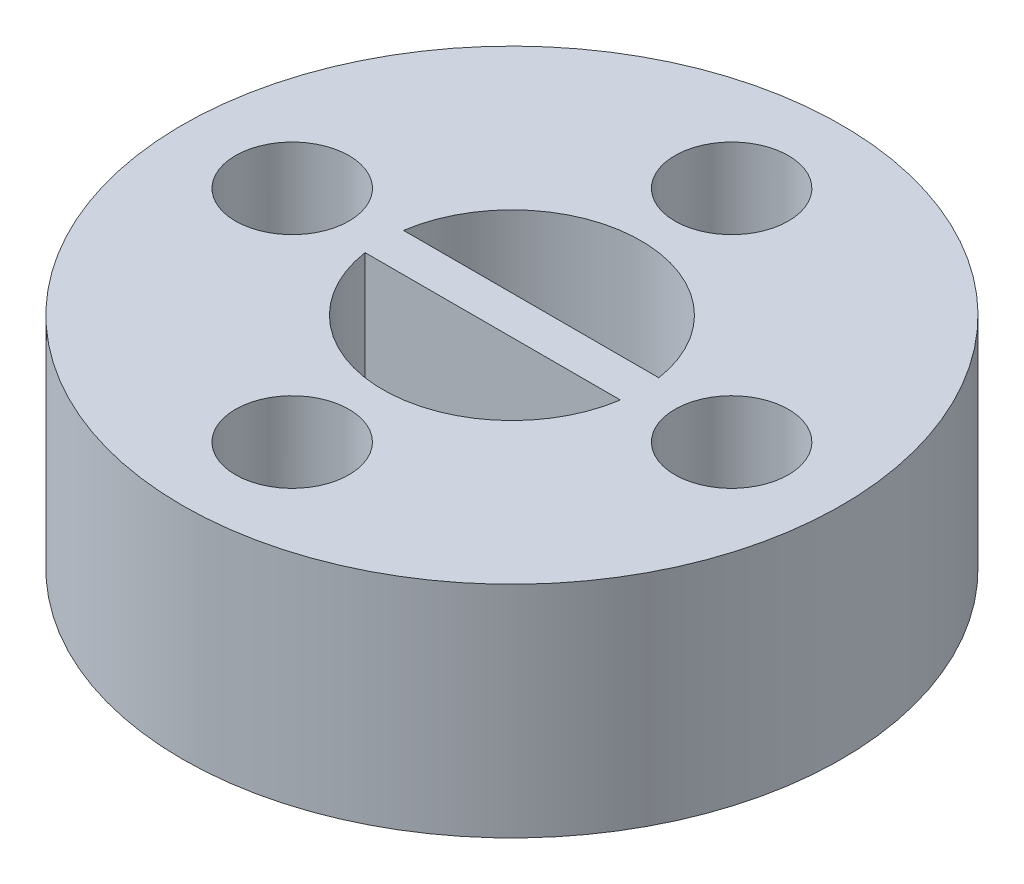
ISO-10303-21;
HEADER;
FILE_DESCRIPTION(('STEP AP214'),'2;1');
FILE_NAME('part.step','',(''),(''),'','','');
FILE_SCHEMA(('AUTOMOTIVE_DESIGN { 1 0 10303 214 1 1 1 1 }'));
ENDSEC;
DATA;
#1=APPLICATION_CONTEXT('core data for automotive mechanical design processes');
#2=APPLICATION_PROTOCOL_DEFINITION('international standard','automotive_design',2000,#1);
#3=PRODUCT_CONTEXT('',#1,'mechanical');
#4=PRODUCT('Part','Part','',(#3));
#5=PRODUCT_RELATED_PRODUCT_CATEGORY('part','',(#4));
#6=PRODUCT_DEFINITION_FORMATION('','',#4);
#7=PRODUCT_DEFINITION_CONTEXT('part definition',#1,'design');
#8=PRODUCT_DEFINITION('design','',#6,#7);
#9=PRODUCT_DEFINITION_SHAPE('','',#8);
#10=(LENGTH_UNIT() NAMED_UNIT(*) SI_UNIT(.MILLI.,.METRE.));
#11=(NAMED_UNIT(*) PLANE_ANGLE_UNIT() SI_UNIT($,.RADIAN.));
#12=(NAMED_UNIT(*) SI_UNIT($,.STERADIAN.) SOLID_ANGLE_UNIT());
#13=UNCERTAINTY_MEASURE_WITH_UNIT(LENGTH_MEASURE(1.E-05),#10,'distance_accuracy_value','');
#14=(GEOMETRIC_REPRESENTATION_CONTEXT(3) GLOBAL_UNCERTAINTY_ASSIGNED_CONTEXT((#13)) GLOBAL_UNIT_ASSIGNED_CONTEXT((#10,
#11,#12)) REPRESENTATION_CONTEXT('',''));
#15=CARTESIAN_POINT('',(0.,0.,0.));
#16=DIRECTION('',(0.,0.,1.));
#17=DIRECTION('',(1.,0.,0.));
#18=AXIS2_PLACEMENT_3D('',#15,#16,#17);
#19=CARTESIAN_POINT('',(0.,6.,0.));
#20=DIRECTION('',(0.,-1.,0.));
#21=DIRECTION('',(0.,0.,-1.));
#22=AXIS2_PLACEMENT_3D('',#19,#20,#21);
#23=CYLINDRICAL_SURFACE('',#22,3.525);
#24=CARTESIAN_POINT('',(0.,6.,0.));
#25=DIRECTION('',(0.,1.,0.));
#26=DIRECTION('',(0.,0.,1.));
#27=AXIS2_PLACEMENT_3D('',#24,#25,#26);
#28=CIRCLE('',#27,3.525);
#29=CARTESIAN_POINT('',(-3.48568501158668,6.,0.525));
#30=VERTEX_POINT('',#29);
#31=CARTESIAN_POINT('',(3.48568501158668,6.,0.525));
#32=VERTEX_POINT('',#31);
#33=EDGE_CURVE('E92',#30,#32,#28,.T.);
#34=ORIENTED_EDGE('',*,*,#33,.T.);
#35=DIRECTION('',(0.,-1.,0.));
#36=VECTOR('',#35,1.);
#37=CARTESIAN_POINT('',(3.48568501158668,6.,0.525));
#38=LINE('',#37,#36);
#39=CARTESIAN_POINT('',(3.48568501158668,0.,0.525));
#40=VERTEX_POINT('',#39);
#41=EDGE_CURVE('E11',#32,#40,#38,.T.);
#42=ORIENTED_EDGE('',*,*,#41,.T.);
#43=CARTESIAN_POINT('',(0.,0.,0.));
#44=DIRECTION('',(0.,1.,0.));
#45=DIRECTION('',(0.,0.,1.));
#46=AXIS2_PLACEMENT_3D('',#43,#44,#45);
#47=CIRCLE('',#46,3.525);
#48=CARTESIAN_POINT('',(-3.48568501158668,0.,0.525));
#49=VERTEX_POINT('',#48);
#50=EDGE_CURVE('E93',#49,#40,#47,.T.);
#51=ORIENTED_EDGE('',*,*,#50,.F.);
#52=DIRECTION('',(0.,-1.,0.));
#53=VECTOR('',#52,1.);
#54=CARTESIAN_POINT('',(-3.48568501158668,6.,0.525));
#55=LINE('',#54,#53);
#56=EDGE_CURVE('E42',#49,#30,#55,.F.);
#57=ORIENTED_EDGE('',*,*,#56,.T.);
#58=EDGE_LOOP('',(#34,#42,#51,#57));
#59=FACE_BOUND('',#58,.T.);
#60=ADVANCED_FACE('F33',(#59),#23,.F.);
#61=CARTESIAN_POINT('',(3.48568501158668,6.,-0.525));
#62=VERTEX_POINT('',#61);
#63=CARTESIAN_POINT('',(-3.48568501158668,6.,-0.525));
#64=VERTEX_POINT('',#63);
#65=EDGE_CURVE('E88',#62,#64,#28,.T.);
#66=ORIENTED_EDGE('',*,*,#65,.T.);
#67=DIRECTION('',(0.,-1.,0.));
#68=VECTOR('',#67,1.);
#69=CARTESIAN_POINT('',(-3.48568501158668,6.,-0.525));
#70=LINE('',#69,#68);
#71=CARTESIAN_POINT('',(-3.48568501158668,0.,-0.525));
#72=VERTEX_POINT('',#71);
#73=EDGE_CURVE('E76',#64,#72,#70,.T.);
#74=ORIENTED_EDGE('',*,*,#73,.T.);
#75=CARTESIAN_POINT('',(3.48568501158668,0.,-0.525));
#76=VERTEX_POINT('',#75);
#77=EDGE_CURVE('E86',#76,#72,#47,.T.);
#78=ORIENTED_EDGE('',*,*,#77,.F.);
#79=DIRECTION('',(0.,-1.,0.));
#80=VECTOR('',#79,1.);
#81=CARTESIAN_POINT('',(3.48568501158668,6.,-0.525));
#82=LINE('',#81,#80);
#83=EDGE_CURVE('E79',#76,#62,#82,.F.);
#84=ORIENTED_EDGE('',*,*,#83,.T.);
#85=EDGE_LOOP('',(#66,#74,#78,#84));
#86=FACE_BOUND('',#85,.T.);
#87=ADVANCED_FACE('F85',(#86),#23,.F.);
#88=CARTESIAN_POINT('',(0.,6.,0.));
#89=DIRECTION('',(0.,1.,0.));
#90=DIRECTION('',(0.,0.,1.));
#91=AXIS2_PLACEMENT_3D('',#88,#89,#90);
#92=PLANE('',#91);
#93=CARTESIAN_POINT('',(0.,6.,6.));
#94=DIRECTION('',(0.,1.,0.));
#95=DIRECTION('',(-1.,0.,0.));
#96=AXIS2_PLACEMENT_3D('',#93,#94,#95);
#97=CIRCLE('',#96,1.55);
#98=CARTESIAN_POINT('',(-1.55000000000002,6.,5.99999999999999));
#99=VERTEX_POINT('',#98);
#100=EDGE_CURVE('E115',#99,#99,#97,.T.);
#101=ORIENTED_EDGE('',*,*,#100,.F.);
#102=EDGE_LOOP('',(#101));
#103=FACE_BOUND('',#102,.T.);
#104=CARTESIAN_POINT('',(-6.,6.,0.));
#105=DIRECTION('',(0.,1.,0.));
#106=DIRECTION('',(0.,0.,-1.));
#107=AXIS2_PLACEMENT_3D('',#104,#105,#106);
#108=CIRCLE('',#107,1.55);
#109=CARTESIAN_POINT('',(-6.,6.,-1.55));
#110=VERTEX_POINT('',#109);
#111=EDGE_CURVE('E176',#110,#110,#108,.T.);
#112=ORIENTED_EDGE('',*,*,#111,.F.);
#113=EDGE_LOOP('',(#112));
#114=FACE_BOUND('',#113,.T.);
#115=CARTESIAN_POINT('',(0.,6.,-6.));
#116=DIRECTION('',(0.,1.,0.));
#117=DIRECTION('',(1.,0.,0.));
#118=AXIS2_PLACEMENT_3D('',#115,#116,#117);
#119=CIRCLE('',#118,1.55);
#120=CARTESIAN_POINT('',(1.55000000000006,6.,-5.99999999999998));
#121=VERTEX_POINT('',#120);
#122=EDGE_CURVE('E128',#121,#121,#119,.T.);
#123=ORIENTED_EDGE('',*,*,#122,.F.);
#124=EDGE_LOOP('',(#123));
#125=FACE_BOUND('',#124,.T.);
#126=CARTESIAN_POINT('',(6.,6.,0.));
#127=DIRECTION('',(0.,1.,0.));
#128=DIRECTION('',(0.,0.,1.));
#129=AXIS2_PLACEMENT_3D('',#126,#127,#128);
#130=CIRCLE('',#129,1.55);
#131=CARTESIAN_POINT('',(6.,6.,1.55));
#132=VERTEX_POINT('',#131);
#133=EDGE_CURVE('E111',#132,#132,#130,.T.);
#134=ORIENTED_EDGE('',*,*,#133,.F.);
#135=EDGE_LOOP('',(#134));
#136=FACE_BOUND('',#135,.T.);
#137=DIRECTION('',(1.,0.,0.));
#138=VECTOR('',#137,1.);
#139=CARTESIAN_POINT('',(-3.525,6.,0.525));
#140=LINE('',#139,#138);
#141=EDGE_CURVE('E81',#30,#32,#140,.T.);
#142=ORIENTED_EDGE('',*,*,#141,.T.);
#143=ORIENTED_EDGE('',*,*,#33,.F.);
#144=EDGE_LOOP('',(#142,#143));
#145=FACE_BOUND('',#144,.T.);
#146=DIRECTION('',(-1.,0.,0.));
#147=VECTOR('',#146,1.);
#148=CARTESIAN_POINT('',(-3.525,6.,-0.525));
#149=LINE('',#148,#147);
#150=EDGE_CURVE('E97',#62,#64,#149,.T.);
#151=ORIENTED_EDGE('',*,*,#150,.T.);
#152=ORIENTED_EDGE('',*,*,#65,.F.);
#153=EDGE_LOOP('',(#151,#152));
#154=FACE_BOUND('',#153,.T.);
#155=CARTESIAN_POINT('',(0.,6.,0.));
#156=DIRECTION('',(0.,1.,0.));
#157=DIRECTION('',(0.,0.,1.));
#158=AXIS2_PLACEMENT_3D('',#155,#156,#157);
#159=CIRCLE('',#158,9.);
#160=CARTESIAN_POINT('',(0.,6.,9.));
#161=VERTEX_POINT('',#160);
#162=EDGE_CURVE('E99',#161,#161,#159,.T.);
#163=ORIENTED_EDGE('',*,*,#162,.T.);
#164=EDGE_LOOP('',(#163));
#165=FACE_BOUND('',#164,.T.);
#166=ADVANCED_FACE('F139',(#103,#114,#125,#136,#145,#154,#165),#92,.T.);
#167=CARTESIAN_POINT('',(0.,0.,0.));
#168=DIRECTION('',(0.,1.,0.));
#169=DIRECTION('',(0.,0.,1.));
#170=AXIS2_PLACEMENT_3D('',#167,#168,#169);
#171=PLANE('',#170);
#172=CARTESIAN_POINT('',(0.,0.,6.));
#173=DIRECTION('',(0.,1.,0.));
#174=DIRECTION('',(0.,0.,1.));
#175=AXIS2_PLACEMENT_3D('',#172,#173,#174);
#176=CIRCLE('',#175,1.55);
#177=CARTESIAN_POINT('',(0.,0.,7.55));
#178=VERTEX_POINT('',#177);
#179=EDGE_CURVE('E37',#178,#178,#176,.T.);
#180=ORIENTED_EDGE('',*,*,#179,.T.);
#181=EDGE_LOOP('',(#180));
#182=FACE_BOUND('',#181,.T.);
#183=CARTESIAN_POINT('',(-6.,0.,0.));
#184=DIRECTION('',(0.,1.,0.));
#185=DIRECTION('',(0.,0.,1.));
#186=AXIS2_PLACEMENT_3D('',#183,#184,#185);
#187=CIRCLE('',#186,1.55);
#188=CARTESIAN_POINT('',(-6.,0.,1.55));
#189=VERTEX_POINT('',#188);
#190=EDGE_CURVE('E114',#189,#189,#187,.T.);
#191=ORIENTED_EDGE('',*,*,#190,.T.);
#192=EDGE_LOOP('',(#191));
#193=FACE_BOUND('',#192,.T.);
#194=CARTESIAN_POINT('',(0.,0.,-6.));
#195=DIRECTION('',(0.,1.,0.));
#196=DIRECTION('',(0.,0.,1.));
#197=AXIS2_PLACEMENT_3D('',#194,#195,#196);
#198=CIRCLE('',#197,1.55);
#199=CARTESIAN_POINT('',(0.,0.,-4.45));
#200=VERTEX_POINT('',#199);
#201=EDGE_CURVE('E112',#200,#200,#198,.T.);
#202=ORIENTED_EDGE('',*,*,#201,.T.);
#203=EDGE_LOOP('',(#202));
#204=FACE_BOUND('',#203,.T.);
#205=CARTESIAN_POINT('',(6.,0.,0.));
#206=DIRECTION('',(0.,1.,0.));
#207=DIRECTION('',(0.,0.,1.));
#208=AXIS2_PLACEMENT_3D('',#205,#206,#207);
#209=CIRCLE('',#208,1.55);
#210=CARTESIAN_POINT('',(6.,0.,1.55));
#211=VERTEX_POINT('',#210);
#212=EDGE_CURVE('E108',#211,#211,#209,.T.);
#213=ORIENTED_EDGE('',*,*,#212,.T.);
#214=EDGE_LOOP('',(#213));
#215=FACE_BOUND('',#214,.T.);
#216=ORIENTED_EDGE('',*,*,#50,.T.);
#217=DIRECTION('',(1.,0.,0.));
#218=VECTOR('',#217,1.);
#219=CARTESIAN_POINT('',(-3.525,0.,0.525));
#220=LINE('',#219,#218);
#221=EDGE_CURVE('E49',#49,#40,#220,.T.);
#222=ORIENTED_EDGE('',*,*,#221,.F.);
#223=EDGE_LOOP('',(#216,#222));
#224=FACE_BOUND('',#223,.T.);
#225=ORIENTED_EDGE('',*,*,#77,.T.);
#226=DIRECTION('',(-1.,0.,0.));
#227=VECTOR('',#226,1.);
#228=CARTESIAN_POINT('',(-3.525,0.,-0.525));
#229=LINE('',#228,#227);
#230=EDGE_CURVE('E56',#76,#72,#229,.T.);
#231=ORIENTED_EDGE('',*,*,#230,.F.);
#232=EDGE_LOOP('',(#225,#231));
#233=FACE_BOUND('',#232,.T.);
#234=CARTESIAN_POINT('',(0.,0.,0.));
#235=DIRECTION('',(0.,1.,0.));
#236=DIRECTION('',(0.,0.,1.));
#237=AXIS2_PLACEMENT_3D('',#234,#235,#236);
#238=CIRCLE('',#237,9.);
#239=CARTESIAN_POINT('',(0.,0.,9.));
#240=VERTEX_POINT('',#239);
#241=EDGE_CURVE('E102',#240,#240,#238,.T.);
#242=ORIENTED_EDGE('',*,*,#241,.F.);
#243=EDGE_LOOP('',(#242));
#244=FACE_BOUND('',#243,.T.);
#245=ADVANCED_FACE('F90',(#182,#193,#204,#215,#224,#233,#244),#171,.F.);
#246=CARTESIAN_POINT('',(0.,6.,0.));
#247=DIRECTION('',(0.,-1.,0.));
#248=DIRECTION('',(0.,0.,-1.));
#249=AXIS2_PLACEMENT_3D('',#246,#247,#248);
#250=CYLINDRICAL_SURFACE('',#249,9.);
#251=ORIENTED_EDGE('',*,*,#162,.F.);
#252=EDGE_LOOP('',(#251));
#253=FACE_BOUND('',#252,.T.);
#254=ORIENTED_EDGE('',*,*,#241,.T.);
#255=EDGE_LOOP('',(#254));
#256=FACE_BOUND('',#255,.T.);
#257=ADVANCED_FACE('F35',(#253,#256),#250,.T.);
#258=CARTESIAN_POINT('',(-3.525,6.,0.525));
#259=DIRECTION('',(0.,0.,-1.));
#260=DIRECTION('',(-1.,0.,0.));
#261=AXIS2_PLACEMENT_3D('',#258,#259,#260);
#262=PLANE('',#261);
#263=ORIENTED_EDGE('',*,*,#41,.F.);
#264=ORIENTED_EDGE('',*,*,#141,.F.);
#265=ORIENTED_EDGE('',*,*,#56,.F.);
#266=ORIENTED_EDGE('',*,*,#221,.T.);
#267=EDGE_LOOP('',(#263,#264,#265,#266));
#268=FACE_BOUND('',#267,.T.);
#269=ADVANCED_FACE('F134',(#268),#262,.F.);
#270=CARTESIAN_POINT('',(-3.525,6.,-0.525));
#271=DIRECTION('',(0.,0.,1.));
#272=DIRECTION('',(1.,0.,0.));
#273=AXIS2_PLACEMENT_3D('',#270,#271,#272);
#274=PLANE('',#273);
#275=ORIENTED_EDGE('',*,*,#73,.F.);
#276=ORIENTED_EDGE('',*,*,#150,.F.);
#277=ORIENTED_EDGE('',*,*,#83,.F.);
#278=ORIENTED_EDGE('',*,*,#230,.T.);
#279=EDGE_LOOP('',(#275,#276,#277,#278));
#280=FACE_BOUND('',#279,.T.);
#281=ADVANCED_FACE('F75',(#280),#274,.F.);
#282=CARTESIAN_POINT('',(6.,-2.,0.));
#283=DIRECTION('',(0.,1.,0.));
#284=DIRECTION('',(0.,0.,1.));
#285=AXIS2_PLACEMENT_3D('',#282,#283,#284);
#286=CYLINDRICAL_SURFACE('',#285,1.55);
#287=ORIENTED_EDGE('',*,*,#133,.T.);
#288=EDGE_LOOP('',(#287));
#289=FACE_BOUND('',#288,.T.);
#290=ORIENTED_EDGE('',*,*,#212,.F.);
#291=EDGE_LOOP('',(#290));
#292=FACE_BOUND('',#291,.T.);
#293=ADVANCED_FACE('F157',(#289,#292),#286,.F.);
#294=CARTESIAN_POINT('',(0.,-2.,-6.));
#295=DIRECTION('',(0.,1.,0.));
#296=DIRECTION('',(0.,0.,1.));
#297=AXIS2_PLACEMENT_3D('',#294,#295,#296);
#298=CYLINDRICAL_SURFACE('',#297,1.55);
#299=ORIENTED_EDGE('',*,*,#122,.T.);
#300=EDGE_LOOP('',(#299));
#301=FACE_BOUND('',#300,.T.);
#302=ORIENTED_EDGE('',*,*,#201,.F.);
#303=EDGE_LOOP('',(#302));
#304=FACE_BOUND('',#303,.T.);
#305=ADVANCED_FACE('F160',(#301,#304),#298,.F.);
#306=CARTESIAN_POINT('',(-6.,-2.,0.));
#307=DIRECTION('',(0.,1.,0.));
#308=DIRECTION('',(0.,0.,1.));
#309=AXIS2_PLACEMENT_3D('',#306,#307,#308);
#310=CYLINDRICAL_SURFACE('',#309,1.55);
#311=ORIENTED_EDGE('',*,*,#111,.T.);
#312=EDGE_LOOP('',(#311));
#313=FACE_BOUND('',#312,.T.);
#314=ORIENTED_EDGE('',*,*,#190,.F.);
#315=EDGE_LOOP('',(#314));
#316=FACE_BOUND('',#315,.T.);
#317=ADVANCED_FACE('F163',(#313,#316),#310,.F.);
#318=CARTESIAN_POINT('',(0.,-2.,6.));
#319=DIRECTION('',(0.,1.,0.));
#320=DIRECTION('',(0.,0.,1.));
#321=AXIS2_PLACEMENT_3D('',#318,#319,#320);
#322=CYLINDRICAL_SURFACE('',#321,1.55);
#323=ORIENTED_EDGE('',*,*,#100,.T.);
#324=EDGE_LOOP('',(#323));
#325=FACE_BOUND('',#324,.T.);
#326=ORIENTED_EDGE('',*,*,#179,.F.);
#327=EDGE_LOOP('',(#326));
#328=FACE_BOUND('',#327,.T.);
#329=ADVANCED_FACE('F167',(#325,#328),#322,.F.);
#330=CLOSED_SHELL('',(#60,#87,#166,#245,#257,#269,#281,#293,#305,#317,#329));
#331=MANIFOLD_SOLID_BREP('B2',#330);
#332=ADVANCED_BREP_SHAPE_REPRESENTATION('',(#18,#331),#14);
#333=SHAPE_DEFINITION_REPRESENTATION(#9,#332);
ENDSEC;
END-ISO-10303-21;
